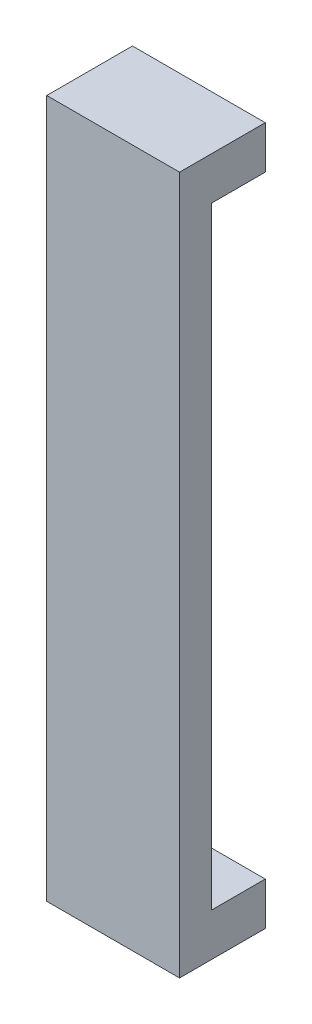
ISO-10303-21;
HEADER;
FILE_DESCRIPTION(('STEP AP214'),'2;1');
FILE_NAME('part.step','',(''),(''),'','','');
FILE_SCHEMA(('AUTOMOTIVE_DESIGN { 1 0 10303 214 1 1 1 1 }'));
ENDSEC;
DATA;
#1=APPLICATION_CONTEXT('core data for automotive mechanical design processes');
#2=APPLICATION_PROTOCOL_DEFINITION('international standard','automotive_design',2000,#1);
#3=PRODUCT_CONTEXT('',#1,'mechanical');
#4=PRODUCT('Part','Part','',(#3));
#5=PRODUCT_RELATED_PRODUCT_CATEGORY('part','',(#4));
#6=PRODUCT_DEFINITION_FORMATION('','',#4);
#7=PRODUCT_DEFINITION_CONTEXT('part definition',#1,'design');
#8=PRODUCT_DEFINITION('design','',#6,#7);
#9=PRODUCT_DEFINITION_SHAPE('','',#8);
#10=(LENGTH_UNIT() NAMED_UNIT(*) SI_UNIT(.MILLI.,.METRE.));
#11=(NAMED_UNIT(*) PLANE_ANGLE_UNIT() SI_UNIT($,.RADIAN.));
#12=(NAMED_UNIT(*) SI_UNIT($,.STERADIAN.) SOLID_ANGLE_UNIT());
#13=UNCERTAINTY_MEASURE_WITH_UNIT(LENGTH_MEASURE(1.E-05),#10,'distance_accuracy_value','');
#14=(GEOMETRIC_REPRESENTATION_CONTEXT(3) GLOBAL_UNCERTAINTY_ASSIGNED_CONTEXT((#13)) GLOBAL_UNIT_ASSIGNED_CONTEXT((#10,
#11,#12)) REPRESENTATION_CONTEXT('',''));
#15=CARTESIAN_POINT('',(0.,0.,0.));
#16=DIRECTION('',(0.,0.,1.));
#17=DIRECTION('',(1.,0.,0.));
#18=AXIS2_PLACEMENT_3D('',#15,#16,#17);
#19=CARTESIAN_POINT('',(-33.648850506839,-28.575,4.));
#20=DIRECTION('',(0.,0.,1.));
#21=DIRECTION('',(1.,0.,0.));
#22=AXIS2_PLACEMENT_3D('',#19,#20,#21);
#23=PLANE('',#22);
#24=DIRECTION('',(0.,1.,0.));
#25=VECTOR('',#24,1.);
#26=CARTESIAN_POINT('',(-21.25,-28.575,4.));
#27=LINE('',#26,#25);
#28=CARTESIAN_POINT('',(-21.25,-32.575,4.));
#29=VERTEX_POINT('',#28);
#30=CARTESIAN_POINT('',(-21.25,-28.575,4.));
#31=VERTEX_POINT('',#30);
#32=EDGE_CURVE('E123',#29,#31,#27,.T.);
#33=ORIENTED_EDGE('',*,*,#32,.F.);
#34=DIRECTION('',(1.,0.,0.));
#35=VECTOR('',#34,1.);
#36=CARTESIAN_POINT('',(-21.25,-32.575,4.));
#37=LINE('',#36,#35);
#38=CARTESIAN_POINT('',(-33.6488505068389,-32.575,4.));
#39=VERTEX_POINT('',#38);
#40=EDGE_CURVE('E155',#39,#29,#37,.T.);
#41=ORIENTED_EDGE('',*,*,#40,.F.);
#42=DIRECTION('',(0.,-1.,0.));
#43=VECTOR('',#42,1.);
#44=CARTESIAN_POINT('',(-33.6488505068389,-32.575,4.));
#45=LINE('',#44,#43);
#46=CARTESIAN_POINT('',(-33.648850506839,-28.575,4.));
#47=VERTEX_POINT('',#46);
#48=EDGE_CURVE('E53',#47,#39,#45,.T.);
#49=ORIENTED_EDGE('',*,*,#48,.F.);
#50=DIRECTION('',(-1.,0.,0.));
#51=VECTOR('',#50,1.);
#52=CARTESIAN_POINT('',(-21.25,-28.575,4.));
#53=LINE('',#52,#51);
#54=EDGE_CURVE('E163',#31,#47,#53,.T.);
#55=ORIENTED_EDGE('',*,*,#54,.F.);
#56=EDGE_LOOP('',(#33,#41,#49,#55));
#57=FACE_BOUND('',#56,.T.);
#58=ADVANCED_FACE('F32',(#57),#23,.F.);
#59=DIRECTION('',(1.,0.,0.));
#60=VECTOR('',#59,1.);
#61=CARTESIAN_POINT('',(-33.648850506839,28.575,4.));
#62=LINE('',#61,#60);
#63=CARTESIAN_POINT('',(-33.648850506839,28.575,4.));
#64=VERTEX_POINT('',#63);
#65=CARTESIAN_POINT('',(-21.25,28.575,4.));
#66=VERTEX_POINT('',#65);
#67=EDGE_CURVE('E124',#64,#66,#62,.T.);
#68=ORIENTED_EDGE('',*,*,#67,.F.);
#69=CARTESIAN_POINT('',(-33.648850506839,32.575,4.));
#70=VERTEX_POINT('',#69);
#71=EDGE_CURVE('E40',#70,#64,#45,.T.);
#72=ORIENTED_EDGE('',*,*,#71,.F.);
#73=DIRECTION('',(-1.,0.,0.));
#74=VECTOR('',#73,1.);
#75=CARTESIAN_POINT('',(-21.25,32.575,4.));
#76=LINE('',#75,#74);
#77=CARTESIAN_POINT('',(-21.25,32.575,4.));
#78=VERTEX_POINT('',#77);
#79=EDGE_CURVE('E11',#78,#70,#76,.T.);
#80=ORIENTED_EDGE('',*,*,#79,.F.);
#81=EDGE_CURVE('E116',#66,#78,#27,.T.);
#82=ORIENTED_EDGE('',*,*,#81,.F.);
#83=EDGE_LOOP('',(#68,#72,#80,#82));
#84=FACE_BOUND('',#83,.T.);
#85=ADVANCED_FACE('F34',(#84),#23,.F.);
#86=CARTESIAN_POINT('',(-33.6488505068389,-32.575,4.));
#87=DIRECTION('',(1.,0.,0.));
#88=DIRECTION('',(0.,1.,0.));
#89=AXIS2_PLACEMENT_3D('',#86,#87,#88);
#90=PLANE('',#89);
#91=DIRECTION('',(0.,0.,-1.));
#92=VECTOR('',#91,1.);
#93=CARTESIAN_POINT('',(-33.648850506839,32.575,4.));
#94=LINE('',#93,#92);
#95=CARTESIAN_POINT('',(-33.648850506839,32.575,12.));
#96=VERTEX_POINT('',#95);
#97=EDGE_CURVE('E150',#96,#70,#94,.T.);
#98=ORIENTED_EDGE('',*,*,#97,.T.);
#99=ORIENTED_EDGE('',*,*,#71,.T.);
#100=DIRECTION('',(0.,0.,-1.));
#101=VECTOR('',#100,1.);
#102=CARTESIAN_POINT('',(-33.648850506839,28.575,12.));
#103=LINE('',#102,#101);
#104=CARTESIAN_POINT('',(-33.648850506839,28.575,9.));
#105=VERTEX_POINT('',#104);
#106=EDGE_CURVE('E142',#105,#64,#103,.T.);
#107=ORIENTED_EDGE('',*,*,#106,.F.);
#108=DIRECTION('',(0.,-1.,0.));
#109=VECTOR('',#108,1.);
#110=CARTESIAN_POINT('',(-33.648850506839,32.575,9.));
#111=LINE('',#110,#109);
#112=CARTESIAN_POINT('',(-33.6488505068389,-28.575,9.));
#113=VERTEX_POINT('',#112);
#114=EDGE_CURVE('E108',#105,#113,#111,.T.);
#115=ORIENTED_EDGE('',*,*,#114,.T.);
#116=DIRECTION('',(0.,0.,-1.));
#117=VECTOR('',#116,1.);
#118=CARTESIAN_POINT('',(-33.648850506839,-28.575,12.));
#119=LINE('',#118,#117);
#120=EDGE_CURVE('E115',#113,#47,#119,.T.);
#121=ORIENTED_EDGE('',*,*,#120,.T.);
#122=ORIENTED_EDGE('',*,*,#48,.T.);
#123=DIRECTION('',(0.,0.,-1.));
#124=VECTOR('',#123,1.);
#125=CARTESIAN_POINT('',(-33.6488505068389,-32.575,4.));
#126=LINE('',#125,#124);
#127=CARTESIAN_POINT('',(-33.648850506839,-32.575,12.));
#128=VERTEX_POINT('',#127);
#129=EDGE_CURVE('E147',#128,#39,#126,.T.);
#130=ORIENTED_EDGE('',*,*,#129,.F.);
#131=DIRECTION('',(0.,-1.,0.));
#132=VECTOR('',#131,1.);
#133=CARTESIAN_POINT('',(-33.648850506839,32.575,12.));
#134=LINE('',#133,#132);
#135=EDGE_CURVE('E127',#96,#128,#134,.T.);
#136=ORIENTED_EDGE('',*,*,#135,.F.);
#137=EDGE_LOOP('',(#98,#99,#107,#115,#121,#122,#130,#136));
#138=FACE_BOUND('',#137,.T.);
#139=ADVANCED_FACE('F158',(#138),#90,.F.);
#140=CARTESIAN_POINT('',(0.,0.,12.));
#141=DIRECTION('',(0.,0.,1.));
#142=DIRECTION('',(1.,0.,0.));
#143=AXIS2_PLACEMENT_3D('',#140,#141,#142);
#144=PLANE('',#143);
#145=ORIENTED_EDGE('',*,*,#135,.T.);
#146=DIRECTION('',(1.,0.,0.));
#147=VECTOR('',#146,1.);
#148=CARTESIAN_POINT('',(-21.25,-32.575,12.));
#149=LINE('',#148,#147);
#150=CARTESIAN_POINT('',(-21.25,-32.575,12.));
#151=VERTEX_POINT('',#150);
#152=EDGE_CURVE('E129',#128,#151,#149,.T.);
#153=ORIENTED_EDGE('',*,*,#152,.T.);
#154=DIRECTION('',(0.,1.,0.));
#155=VECTOR('',#154,1.);
#156=CARTESIAN_POINT('',(-21.25,32.575,12.));
#157=LINE('',#156,#155);
#158=CARTESIAN_POINT('',(-21.25,32.575,12.));
#159=VERTEX_POINT('',#158);
#160=EDGE_CURVE('E134',#151,#159,#157,.T.);
#161=ORIENTED_EDGE('',*,*,#160,.T.);
#162=DIRECTION('',(-1.,0.,0.));
#163=VECTOR('',#162,1.);
#164=CARTESIAN_POINT('',(-33.648850506839,32.575,12.));
#165=LINE('',#164,#163);
#166=EDGE_CURVE('E137',#159,#96,#165,.T.);
#167=ORIENTED_EDGE('',*,*,#166,.T.);
#168=EDGE_LOOP('',(#145,#153,#161,#167));
#169=FACE_BOUND('',#168,.T.);
#170=ADVANCED_FACE('F170',(#169),#144,.T.);
#171=CARTESIAN_POINT('',(-21.25,32.575,4.));
#172=DIRECTION('',(0.,-1.,0.));
#173=DIRECTION('',(0.,0.,-1.));
#174=AXIS2_PLACEMENT_3D('',#171,#172,#173);
#175=PLANE('',#174);
#176=DIRECTION('',(0.,0.,-1.));
#177=VECTOR('',#176,1.);
#178=CARTESIAN_POINT('',(-21.25,32.575,4.));
#179=LINE('',#178,#177);
#180=EDGE_CURVE('E117',#159,#78,#179,.T.);
#181=ORIENTED_EDGE('',*,*,#180,.T.);
#182=ORIENTED_EDGE('',*,*,#79,.T.);
#183=ORIENTED_EDGE('',*,*,#97,.F.);
#184=ORIENTED_EDGE('',*,*,#166,.F.);
#185=EDGE_LOOP('',(#181,#182,#183,#184));
#186=FACE_BOUND('',#185,.T.);
#187=ADVANCED_FACE('F175',(#186),#175,.F.);
#188=CARTESIAN_POINT('',(-33.648850506839,28.575,12.));
#189=DIRECTION('',(0.,1.,0.));
#190=DIRECTION('',(0.,0.,1.));
#191=AXIS2_PLACEMENT_3D('',#188,#189,#190);
#192=PLANE('',#191);
#193=DIRECTION('',(1.,0.,0.));
#194=VECTOR('',#193,1.);
#195=CARTESIAN_POINT('',(-33.648850506839,28.575,9.));
#196=LINE('',#195,#194);
#197=CARTESIAN_POINT('',(-21.25,28.575,9.));
#198=VERTEX_POINT('',#197);
#199=EDGE_CURVE('E103',#105,#198,#196,.T.);
#200=ORIENTED_EDGE('',*,*,#199,.F.);
#201=ORIENTED_EDGE('',*,*,#106,.T.);
#202=ORIENTED_EDGE('',*,*,#67,.T.);
#203=DIRECTION('',(0.,0.,-1.));
#204=VECTOR('',#203,1.);
#205=CARTESIAN_POINT('',(-21.25,28.575,12.));
#206=LINE('',#205,#204);
#207=EDGE_CURVE('E139',#198,#66,#206,.T.);
#208=ORIENTED_EDGE('',*,*,#207,.F.);
#209=EDGE_LOOP('',(#200,#201,#202,#208));
#210=FACE_BOUND('',#209,.T.);
#211=ADVANCED_FACE('F162',(#210),#192,.F.);
#212=CARTESIAN_POINT('',(0.,0.,9.));
#213=DIRECTION('',(0.,0.,1.));
#214=DIRECTION('',(1.,0.,0.));
#215=AXIS2_PLACEMENT_3D('',#212,#213,#214);
#216=PLANE('',#215);
#217=ORIENTED_EDGE('',*,*,#114,.F.);
#218=ORIENTED_EDGE('',*,*,#199,.T.);
#219=DIRECTION('',(0.,1.,0.));
#220=VECTOR('',#219,1.);
#221=CARTESIAN_POINT('',(-21.25,32.575,9.));
#222=LINE('',#221,#220);
#223=CARTESIAN_POINT('',(-21.25,-28.575,9.));
#224=VERTEX_POINT('',#223);
#225=EDGE_CURVE('E97',#224,#198,#222,.T.);
#226=ORIENTED_EDGE('',*,*,#225,.F.);
#227=DIRECTION('',(-1.,0.,0.));
#228=VECTOR('',#227,1.);
#229=CARTESIAN_POINT('',(-21.25,-28.575,9.));
#230=LINE('',#229,#228);
#231=EDGE_CURVE('E100',#224,#113,#230,.T.);
#232=ORIENTED_EDGE('',*,*,#231,.T.);
#233=EDGE_LOOP('',(#217,#218,#226,#232));
#234=FACE_BOUND('',#233,.T.);
#235=ADVANCED_FACE('F99',(#234),#216,.F.);
#236=CARTESIAN_POINT('',(-21.25,-28.575,12.));
#237=DIRECTION('',(0.,-1.,0.));
#238=DIRECTION('',(0.,0.,-1.));
#239=AXIS2_PLACEMENT_3D('',#236,#237,#238);
#240=PLANE('',#239);
#241=ORIENTED_EDGE('',*,*,#231,.F.);
#242=DIRECTION('',(0.,0.,-1.));
#243=VECTOR('',#242,1.);
#244=CARTESIAN_POINT('',(-21.25,-28.575,12.));
#245=LINE('',#244,#243);
#246=EDGE_CURVE('E114',#224,#31,#245,.T.);
#247=ORIENTED_EDGE('',*,*,#246,.T.);
#248=ORIENTED_EDGE('',*,*,#54,.T.);
#249=ORIENTED_EDGE('',*,*,#120,.F.);
#250=EDGE_LOOP('',(#241,#247,#248,#249));
#251=FACE_BOUND('',#250,.T.);
#252=ADVANCED_FACE('F113',(#251),#240,.F.);
#253=CARTESIAN_POINT('',(-21.25,-32.575,4.));
#254=DIRECTION('',(0.,1.,0.));
#255=DIRECTION('',(0.,0.,1.));
#256=AXIS2_PLACEMENT_3D('',#253,#254,#255);
#257=PLANE('',#256);
#258=ORIENTED_EDGE('',*,*,#129,.T.);
#259=ORIENTED_EDGE('',*,*,#40,.T.);
#260=DIRECTION('',(0.,0.,-1.));
#261=VECTOR('',#260,1.);
#262=CARTESIAN_POINT('',(-21.25,-32.575,4.));
#263=LINE('',#262,#261);
#264=EDGE_CURVE('E145',#151,#29,#263,.T.);
#265=ORIENTED_EDGE('',*,*,#264,.F.);
#266=ORIENTED_EDGE('',*,*,#152,.F.);
#267=EDGE_LOOP('',(#258,#259,#265,#266));
#268=FACE_BOUND('',#267,.T.);
#269=ADVANCED_FACE('F174',(#268),#257,.F.);
#270=CARTESIAN_POINT('',(-21.25,-28.575,4.));
#271=DIRECTION('',(-1.,0.,0.));
#272=DIRECTION('',(0.,0.,1.));
#273=AXIS2_PLACEMENT_3D('',#270,#271,#272);
#274=PLANE('',#273);
#275=ORIENTED_EDGE('',*,*,#264,.T.);
#276=ORIENTED_EDGE('',*,*,#32,.T.);
#277=ORIENTED_EDGE('',*,*,#246,.F.);
#278=ORIENTED_EDGE('',*,*,#225,.T.);
#279=ORIENTED_EDGE('',*,*,#207,.T.);
#280=ORIENTED_EDGE('',*,*,#81,.T.);
#281=ORIENTED_EDGE('',*,*,#180,.F.);
#282=ORIENTED_EDGE('',*,*,#160,.F.);
#283=EDGE_LOOP('',(#275,#276,#277,#278,#279,#280,#281,#282));
#284=FACE_BOUND('',#283,.T.);
#285=ADVANCED_FACE('F121',(#284),#274,.F.);
#286=CLOSED_SHELL('',(#58,#85,#139,#170,#187,#211,#235,#252,#269,#285));
#287=MANIFOLD_SOLID_BREP('B2',#286);
#288=ADVANCED_BREP_SHAPE_REPRESENTATION('',(#18,#287),#14);
#289=SHAPE_DEFINITION_REPRESENTATION(#9,#288);
ENDSEC;
END-ISO-10303-21;
